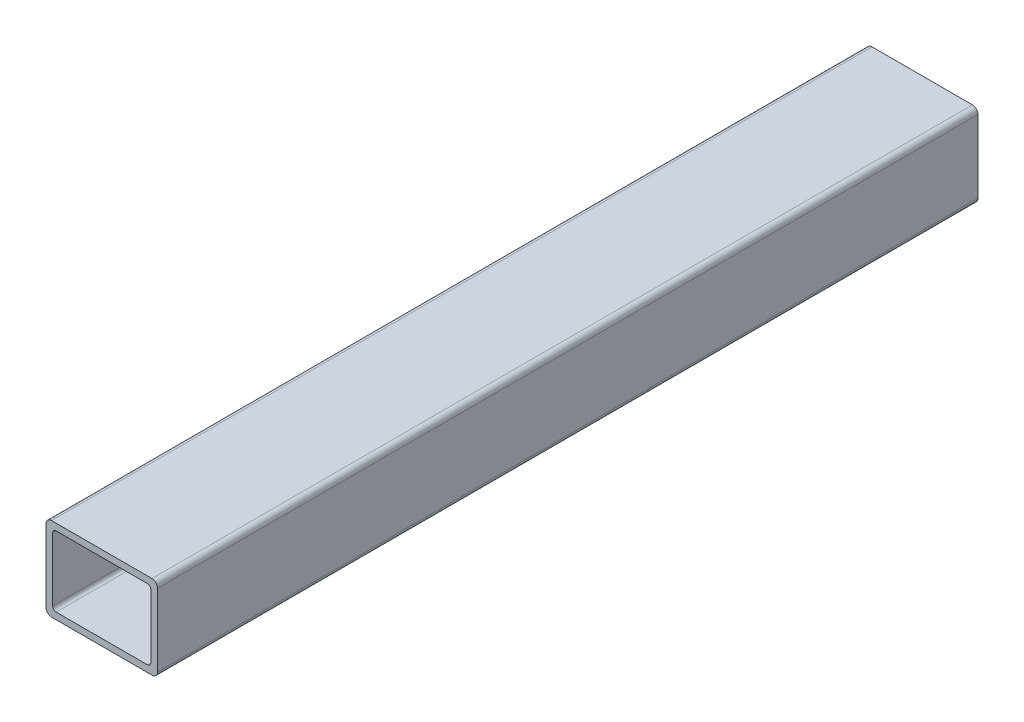
ISO-10303-21;
HEADER;
FILE_DESCRIPTION(('STEP AP214'),'2;1');
FILE_NAME('part.step','',(''),(''),'','','');
FILE_SCHEMA(('AUTOMOTIVE_DESIGN { 1 0 10303 214 1 1 1 1 }'));
ENDSEC;
DATA;
#1=APPLICATION_CONTEXT('core data for automotive mechanical design processes');
#2=APPLICATION_PROTOCOL_DEFINITION('international standard','automotive_design',2000,#1);
#3=PRODUCT_CONTEXT('',#1,'mechanical');
#4=PRODUCT('Part','Part','',(#3));
#5=PRODUCT_RELATED_PRODUCT_CATEGORY('part','',(#4));
#6=PRODUCT_DEFINITION_FORMATION('','',#4);
#7=PRODUCT_DEFINITION_CONTEXT('part definition',#1,'design');
#8=PRODUCT_DEFINITION('design','',#6,#7);
#9=PRODUCT_DEFINITION_SHAPE('','',#8);
#10=(LENGTH_UNIT() NAMED_UNIT(*) SI_UNIT(.MILLI.,.METRE.));
#11=(NAMED_UNIT(*) PLANE_ANGLE_UNIT() SI_UNIT($,.RADIAN.));
#12=(NAMED_UNIT(*) SI_UNIT($,.STERADIAN.) SOLID_ANGLE_UNIT());
#13=UNCERTAINTY_MEASURE_WITH_UNIT(LENGTH_MEASURE(1.E-05),#10,'distance_accuracy_value','');
#14=(GEOMETRIC_REPRESENTATION_CONTEXT(3) GLOBAL_UNCERTAINTY_ASSIGNED_CONTEXT((#13)) GLOBAL_UNIT_ASSIGNED_CONTEXT((#10,
#11,#12)) REPRESENTATION_CONTEXT('',''));
#15=CARTESIAN_POINT('',(0.,0.,0.));
#16=DIRECTION('',(0.,0.,1.));
#17=DIRECTION('',(1.,0.,0.));
#18=AXIS2_PLACEMENT_3D('',#15,#16,#17);
#19=CARTESIAN_POINT('',(22.86,-16.51,373.61368));
#20=DIRECTION('',(0.,0.,1.));
#21=DIRECTION('',(1.,0.,0.));
#22=AXIS2_PLACEMENT_3D('',#19,#20,#21);
#23=PLANE('',#22);
#24=CARTESIAN_POINT('',(22.86,-16.51,373.61368));
#25=DIRECTION('',(0.,0.,1.));
#26=DIRECTION('',(1.,0.,0.));
#27=AXIS2_PLACEMENT_3D('',#24,#25,#26);
#28=CIRCLE('',#27,2.53999999999999);
#29=CARTESIAN_POINT('',(22.86,-19.05,373.61368));
#30=VERTEX_POINT('',#29);
#31=CARTESIAN_POINT('',(25.4,-16.51,373.61368));
#32=VERTEX_POINT('',#31);
#33=EDGE_CURVE('E214',#30,#32,#28,.T.);
#34=ORIENTED_EDGE('',*,*,#33,.T.);
#35=DIRECTION('',(0.,1.,0.));
#36=VECTOR('',#35,1.);
#37=CARTESIAN_POINT('',(25.4,-16.51,373.61368));
#38=LINE('',#37,#36);
#39=CARTESIAN_POINT('',(25.4,16.51,373.61368));
#40=VERTEX_POINT('',#39);
#41=EDGE_CURVE('E217',#32,#40,#38,.T.);
#42=ORIENTED_EDGE('',*,*,#41,.T.);
#43=CARTESIAN_POINT('',(22.86,16.51,373.61368));
#44=DIRECTION('',(0.,0.,1.));
#45=DIRECTION('',(1.,0.,0.));
#46=AXIS2_PLACEMENT_3D('',#43,#44,#45);
#47=CIRCLE('',#46,2.54);
#48=CARTESIAN_POINT('',(22.86,19.05,373.61368));
#49=VERTEX_POINT('',#48);
#50=EDGE_CURVE('E220',#40,#49,#47,.T.);
#51=ORIENTED_EDGE('',*,*,#50,.T.);
#52=DIRECTION('',(-1.,0.,0.));
#53=VECTOR('',#52,1.);
#54=CARTESIAN_POINT('',(22.86,19.05,373.61368));
#55=LINE('',#54,#53);
#56=CARTESIAN_POINT('',(-22.86,19.05,373.61368));
#57=VERTEX_POINT('',#56);
#58=EDGE_CURVE('E222',#49,#57,#55,.T.);
#59=ORIENTED_EDGE('',*,*,#58,.T.);
#60=CARTESIAN_POINT('',(-22.86,16.51,373.61368));
#61=DIRECTION('',(0.,0.,1.));
#62=DIRECTION('',(1.,0.,0.));
#63=AXIS2_PLACEMENT_3D('',#60,#61,#62);
#64=CIRCLE('',#63,2.54);
#65=CARTESIAN_POINT('',(-25.4,16.51,373.61368));
#66=VERTEX_POINT('',#65);
#67=EDGE_CURVE('E224',#57,#66,#64,.T.);
#68=ORIENTED_EDGE('',*,*,#67,.T.);
#69=DIRECTION('',(0.,-1.,0.));
#70=VECTOR('',#69,1.);
#71=CARTESIAN_POINT('',(-25.4,-16.51,373.61368));
#72=LINE('',#71,#70);
#73=CARTESIAN_POINT('',(-25.4,-16.51,373.61368));
#74=VERTEX_POINT('',#73);
#75=EDGE_CURVE('E226',#66,#74,#72,.T.);
#76=ORIENTED_EDGE('',*,*,#75,.T.);
#77=CARTESIAN_POINT('',(-22.86,-16.51,373.61368));
#78=DIRECTION('',(0.,0.,1.));
#79=DIRECTION('',(1.,0.,0.));
#80=AXIS2_PLACEMENT_3D('',#77,#78,#79);
#81=CIRCLE('',#80,2.54);
#82=CARTESIAN_POINT('',(-22.86,-19.05,373.61368));
#83=VERTEX_POINT('',#82);
#84=EDGE_CURVE('E228',#74,#83,#81,.T.);
#85=ORIENTED_EDGE('',*,*,#84,.T.);
#86=DIRECTION('',(1.,0.,0.));
#87=VECTOR('',#86,1.);
#88=CARTESIAN_POINT('',(22.86,-19.05,373.61368));
#89=LINE('',#88,#87);
#90=EDGE_CURVE('E230',#83,#30,#89,.T.);
#91=ORIENTED_EDGE('',*,*,#90,.T.);
#92=EDGE_LOOP('',(#34,#42,#51,#59,#68,#76,#85,#91));
#93=FACE_BOUND('',#92,.T.);
#94=DIRECTION('',(-1.,0.,0.));
#95=VECTOR('',#94,1.);
#96=CARTESIAN_POINT('',(20.7518,16.002,373.61368));
#97=LINE('',#96,#95);
#98=CARTESIAN_POINT('',(20.7518,16.002,373.61368));
#99=VERTEX_POINT('',#98);
#100=CARTESIAN_POINT('',(-20.7518,16.002,373.61368));
#101=VERTEX_POINT('',#100);
#102=EDGE_CURVE('E157',#99,#101,#97,.T.);
#103=ORIENTED_EDGE('',*,*,#102,.F.);
#104=CARTESIAN_POINT('',(20.7518,14.4018,373.61368));
#105=DIRECTION('',(0.,0.,1.));
#106=DIRECTION('',(1.,0.,0.));
#107=AXIS2_PLACEMENT_3D('',#104,#105,#106);
#108=CIRCLE('',#107,1.6002);
#109=CARTESIAN_POINT('',(22.352,14.4018,373.61368));
#110=VERTEX_POINT('',#109);
#111=EDGE_CURVE('E149',#110,#99,#108,.T.);
#112=ORIENTED_EDGE('',*,*,#111,.F.);
#113=DIRECTION('',(0.,1.,0.));
#114=VECTOR('',#113,1.);
#115=CARTESIAN_POINT('',(22.352,14.4018,373.61368));
#116=LINE('',#115,#114);
#117=CARTESIAN_POINT('',(22.352,-14.4018,373.61368));
#118=VERTEX_POINT('',#117);
#119=EDGE_CURVE('E182',#118,#110,#116,.T.);
#120=ORIENTED_EDGE('',*,*,#119,.F.);
#121=CARTESIAN_POINT('',(20.7518,-14.4018,373.61368));
#122=DIRECTION('',(0.,0.,1.));
#123=DIRECTION('',(1.,0.,0.));
#124=AXIS2_PLACEMENT_3D('',#121,#122,#123);
#125=CIRCLE('',#124,1.6002);
#126=CARTESIAN_POINT('',(20.7518,-16.002,373.61368));
#127=VERTEX_POINT('',#126);
#128=EDGE_CURVE('E180',#127,#118,#125,.T.);
#129=ORIENTED_EDGE('',*,*,#128,.F.);
#130=DIRECTION('',(1.,0.,0.));
#131=VECTOR('',#130,1.);
#132=CARTESIAN_POINT('',(20.7518,-16.002,373.61368));
#133=LINE('',#132,#131);
#134=CARTESIAN_POINT('',(-20.7518,-16.002,373.61368));
#135=VERTEX_POINT('',#134);
#136=EDGE_CURVE('E178',#135,#127,#133,.T.);
#137=ORIENTED_EDGE('',*,*,#136,.F.);
#138=CARTESIAN_POINT('',(-20.7518,-14.4018,373.61368));
#139=DIRECTION('',(0.,0.,1.));
#140=DIRECTION('',(1.,0.,0.));
#141=AXIS2_PLACEMENT_3D('',#138,#139,#140);
#142=CIRCLE('',#141,1.6002);
#143=CARTESIAN_POINT('',(-22.352,-14.4018,373.61368));
#144=VERTEX_POINT('',#143);
#145=EDGE_CURVE('E176',#144,#135,#142,.T.);
#146=ORIENTED_EDGE('',*,*,#145,.F.);
#147=DIRECTION('',(0.,-1.,0.));
#148=VECTOR('',#147,1.);
#149=CARTESIAN_POINT('',(-22.352,14.4018,373.61368));
#150=LINE('',#149,#148);
#151=CARTESIAN_POINT('',(-22.352,14.4018,373.61368));
#152=VERTEX_POINT('',#151);
#153=EDGE_CURVE('E172',#152,#144,#150,.T.);
#154=ORIENTED_EDGE('',*,*,#153,.F.);
#155=CARTESIAN_POINT('',(-20.7518,14.4018,373.61368));
#156=DIRECTION('',(0.,0.,1.));
#157=DIRECTION('',(1.,0.,0.));
#158=AXIS2_PLACEMENT_3D('',#155,#156,#157);
#159=CIRCLE('',#158,1.6002);
#160=EDGE_CURVE('E170',#101,#152,#159,.T.);
#161=ORIENTED_EDGE('',*,*,#160,.F.);
#162=EDGE_LOOP('',(#103,#112,#120,#129,#137,#146,#154,#161));
#163=FACE_BOUND('',#162,.T.);
#164=ADVANCED_FACE('F36',(#93,#163),#23,.T.);
#165=CARTESIAN_POINT('',(22.86,-16.51,0.));
#166=DIRECTION('',(0.,0.,1.));
#167=DIRECTION('',(1.,0.,0.));
#168=AXIS2_PLACEMENT_3D('',#165,#166,#167);
#169=PLANE('',#168);
#170=CARTESIAN_POINT('',(22.86,-16.51,0.));
#171=DIRECTION('',(0.,0.,1.));
#172=DIRECTION('',(1.,0.,0.));
#173=AXIS2_PLACEMENT_3D('',#170,#171,#172);
#174=CIRCLE('',#173,2.53999999999999);
#175=CARTESIAN_POINT('',(22.86,-19.05,0.));
#176=VERTEX_POINT('',#175);
#177=CARTESIAN_POINT('',(25.4,-16.51,0.));
#178=VERTEX_POINT('',#177);
#179=EDGE_CURVE('E165',#176,#178,#174,.T.);
#180=ORIENTED_EDGE('',*,*,#179,.F.);
#181=DIRECTION('',(1.,0.,0.));
#182=VECTOR('',#181,1.);
#183=CARTESIAN_POINT('',(22.86,-19.05,0.));
#184=LINE('',#183,#182);
#185=CARTESIAN_POINT('',(-22.86,-19.05,0.));
#186=VERTEX_POINT('',#185);
#187=EDGE_CURVE('E218',#186,#176,#184,.T.);
#188=ORIENTED_EDGE('',*,*,#187,.F.);
#189=CARTESIAN_POINT('',(-22.86,-16.51,0.));
#190=DIRECTION('',(0.,0.,1.));
#191=DIRECTION('',(1.,0.,0.));
#192=AXIS2_PLACEMENT_3D('',#189,#190,#191);
#193=CIRCLE('',#192,2.54);
#194=CARTESIAN_POINT('',(-25.4,-16.51,0.));
#195=VERTEX_POINT('',#194);
#196=EDGE_CURVE('E245',#195,#186,#193,.T.);
#197=ORIENTED_EDGE('',*,*,#196,.F.);
#198=DIRECTION('',(0.,-1.,0.));
#199=VECTOR('',#198,1.);
#200=CARTESIAN_POINT('',(-25.4,-16.51,0.));
#201=LINE('',#200,#199);
#202=CARTESIAN_POINT('',(-25.4,16.51,0.));
#203=VERTEX_POINT('',#202);
#204=EDGE_CURVE('E243',#203,#195,#201,.T.);
#205=ORIENTED_EDGE('',*,*,#204,.F.);
#206=CARTESIAN_POINT('',(-22.86,16.51,0.));
#207=DIRECTION('',(0.,0.,1.));
#208=DIRECTION('',(1.,0.,0.));
#209=AXIS2_PLACEMENT_3D('',#206,#207,#208);
#210=CIRCLE('',#209,2.54);
#211=CARTESIAN_POINT('',(-22.86,19.05,0.));
#212=VERTEX_POINT('',#211);
#213=EDGE_CURVE('E241',#212,#203,#210,.T.);
#214=ORIENTED_EDGE('',*,*,#213,.F.);
#215=DIRECTION('',(-1.,0.,0.));
#216=VECTOR('',#215,1.);
#217=CARTESIAN_POINT('',(22.86,19.05,0.));
#218=LINE('',#217,#216);
#219=CARTESIAN_POINT('',(22.86,19.05,0.));
#220=VERTEX_POINT('',#219);
#221=EDGE_CURVE('E239',#220,#212,#218,.T.);
#222=ORIENTED_EDGE('',*,*,#221,.F.);
#223=CARTESIAN_POINT('',(22.86,16.51,0.));
#224=DIRECTION('',(0.,0.,1.));
#225=DIRECTION('',(1.,0.,0.));
#226=AXIS2_PLACEMENT_3D('',#223,#224,#225);
#227=CIRCLE('',#226,2.54);
#228=CARTESIAN_POINT('',(25.4,16.51,0.));
#229=VERTEX_POINT('',#228);
#230=EDGE_CURVE('E237',#229,#220,#227,.T.);
#231=ORIENTED_EDGE('',*,*,#230,.F.);
#232=DIRECTION('',(0.,1.,0.));
#233=VECTOR('',#232,1.);
#234=CARTESIAN_POINT('',(25.4,-16.51,0.));
#235=LINE('',#234,#233);
#236=EDGE_CURVE('E235',#178,#229,#235,.T.);
#237=ORIENTED_EDGE('',*,*,#236,.F.);
#238=EDGE_LOOP('',(#180,#188,#197,#205,#214,#222,#231,#237));
#239=FACE_BOUND('',#238,.T.);
#240=CARTESIAN_POINT('',(20.7518,14.4018,0.));
#241=DIRECTION('',(0.,0.,1.));
#242=DIRECTION('',(1.,0.,0.));
#243=AXIS2_PLACEMENT_3D('',#240,#241,#242);
#244=CIRCLE('',#243,1.6002);
#245=CARTESIAN_POINT('',(22.352,14.4018,0.));
#246=VERTEX_POINT('',#245);
#247=CARTESIAN_POINT('',(20.7518,16.002,0.));
#248=VERTEX_POINT('',#247);
#249=EDGE_CURVE('E59',#246,#248,#244,.T.);
#250=ORIENTED_EDGE('',*,*,#249,.T.);
#251=DIRECTION('',(-1.,0.,0.));
#252=VECTOR('',#251,1.);
#253=CARTESIAN_POINT('',(20.7518,16.002,0.));
#254=LINE('',#253,#252);
#255=CARTESIAN_POINT('',(-20.7518,16.002,0.));
#256=VERTEX_POINT('',#255);
#257=EDGE_CURVE('E164',#248,#256,#254,.T.);
#258=ORIENTED_EDGE('',*,*,#257,.T.);
#259=CARTESIAN_POINT('',(-20.7518,14.4018,0.));
#260=DIRECTION('',(0.,0.,1.));
#261=DIRECTION('',(1.,0.,0.));
#262=AXIS2_PLACEMENT_3D('',#259,#260,#261);
#263=CIRCLE('',#262,1.6002);
#264=CARTESIAN_POINT('',(-22.352,14.4018,0.));
#265=VERTEX_POINT('',#264);
#266=EDGE_CURVE('E186',#256,#265,#263,.T.);
#267=ORIENTED_EDGE('',*,*,#266,.T.);
#268=DIRECTION('',(0.,-1.,0.));
#269=VECTOR('',#268,1.);
#270=CARTESIAN_POINT('',(-22.352,14.4018,0.));
#271=LINE('',#270,#269);
#272=CARTESIAN_POINT('',(-22.352,-14.4018,0.));
#273=VERTEX_POINT('',#272);
#274=EDGE_CURVE('E189',#265,#273,#271,.T.);
#275=ORIENTED_EDGE('',*,*,#274,.T.);
#276=CARTESIAN_POINT('',(-20.7518,-14.4018,0.));
#277=DIRECTION('',(0.,0.,1.));
#278=DIRECTION('',(1.,0.,0.));
#279=AXIS2_PLACEMENT_3D('',#276,#277,#278);
#280=CIRCLE('',#279,1.6002);
#281=CARTESIAN_POINT('',(-20.7518,-16.002,0.));
#282=VERTEX_POINT('',#281);
#283=EDGE_CURVE('E192',#273,#282,#280,.T.);
#284=ORIENTED_EDGE('',*,*,#283,.T.);
#285=DIRECTION('',(1.,0.,0.));
#286=VECTOR('',#285,1.);
#287=CARTESIAN_POINT('',(20.7518,-16.002,0.));
#288=LINE('',#287,#286);
#289=CARTESIAN_POINT('',(20.7518,-16.002,0.));
#290=VERTEX_POINT('',#289);
#291=EDGE_CURVE('E195',#282,#290,#288,.T.);
#292=ORIENTED_EDGE('',*,*,#291,.T.);
#293=CARTESIAN_POINT('',(20.7518,-14.4018,0.));
#294=DIRECTION('',(0.,0.,1.));
#295=DIRECTION('',(1.,0.,0.));
#296=AXIS2_PLACEMENT_3D('',#293,#294,#295);
#297=CIRCLE('',#296,1.6002);
#298=CARTESIAN_POINT('',(22.352,-14.4018,0.));
#299=VERTEX_POINT('',#298);
#300=EDGE_CURVE('E198',#290,#299,#297,.T.);
#301=ORIENTED_EDGE('',*,*,#300,.T.);
#302=DIRECTION('',(0.,1.,0.));
#303=VECTOR('',#302,1.);
#304=CARTESIAN_POINT('',(22.352,14.4018,0.));
#305=LINE('',#304,#303);
#306=EDGE_CURVE('E158',#299,#246,#305,.T.);
#307=ORIENTED_EDGE('',*,*,#306,.T.);
#308=EDGE_LOOP('',(#250,#258,#267,#275,#284,#292,#301,#307));
#309=FACE_BOUND('',#308,.T.);
#310=ADVANCED_FACE('F275',(#239,#309),#169,.F.);
#311=CARTESIAN_POINT('',(22.86,-16.51,373.61368));
#312=DIRECTION('',(0.,0.,-1.));
#313=DIRECTION('',(-1.,0.,0.));
#314=AXIS2_PLACEMENT_3D('',#311,#312,#313);
#315=CYLINDRICAL_SURFACE('',#314,2.53999999999999);
#316=ORIENTED_EDGE('',*,*,#179,.T.);
#317=DIRECTION('',(0.,0.,-1.));
#318=VECTOR('',#317,1.);
#319=CARTESIAN_POINT('',(25.4,-16.51,373.61368));
#320=LINE('',#319,#318);
#321=EDGE_CURVE('E11',#32,#178,#320,.T.);
#322=ORIENTED_EDGE('',*,*,#321,.F.);
#323=ORIENTED_EDGE('',*,*,#33,.F.);
#324=DIRECTION('',(0.,0.,-1.));
#325=VECTOR('',#324,1.);
#326=CARTESIAN_POINT('',(22.86,-19.05,373.61368));
#327=LINE('',#326,#325);
#328=EDGE_CURVE('E232',#30,#176,#327,.T.);
#329=ORIENTED_EDGE('',*,*,#328,.T.);
#330=EDGE_LOOP('',(#316,#322,#323,#329));
#331=FACE_BOUND('',#330,.T.);
#332=ADVANCED_FACE('F38',(#331),#315,.T.);
#333=CARTESIAN_POINT('',(25.4,-16.51,373.61368));
#334=DIRECTION('',(-1.,0.,0.));
#335=DIRECTION('',(0.,0.,1.));
#336=AXIS2_PLACEMENT_3D('',#333,#334,#335);
#337=PLANE('',#336);
#338=ORIENTED_EDGE('',*,*,#236,.T.);
#339=DIRECTION('',(0.,0.,-1.));
#340=VECTOR('',#339,1.);
#341=CARTESIAN_POINT('',(25.4,16.51,373.61368));
#342=LINE('',#341,#340);
#343=EDGE_CURVE('E44',#40,#229,#342,.T.);
#344=ORIENTED_EDGE('',*,*,#343,.F.);
#345=ORIENTED_EDGE('',*,*,#41,.F.);
#346=ORIENTED_EDGE('',*,*,#321,.T.);
#347=EDGE_LOOP('',(#338,#344,#345,#346));
#348=FACE_BOUND('',#347,.T.);
#349=ADVANCED_FACE('F292',(#348),#337,.F.);
#350=CARTESIAN_POINT('',(22.86,16.51,373.61368));
#351=DIRECTION('',(0.,0.,-1.));
#352=DIRECTION('',(-1.,0.,0.));
#353=AXIS2_PLACEMENT_3D('',#350,#351,#352);
#354=CYLINDRICAL_SURFACE('',#353,2.54);
#355=ORIENTED_EDGE('',*,*,#230,.T.);
#356=DIRECTION('',(0.,0.,-1.));
#357=VECTOR('',#356,1.);
#358=CARTESIAN_POINT('',(22.86,19.05,373.61368));
#359=LINE('',#358,#357);
#360=EDGE_CURVE('E262',#49,#220,#359,.T.);
#361=ORIENTED_EDGE('',*,*,#360,.F.);
#362=ORIENTED_EDGE('',*,*,#50,.F.);
#363=ORIENTED_EDGE('',*,*,#343,.T.);
#364=EDGE_LOOP('',(#355,#361,#362,#363));
#365=FACE_BOUND('',#364,.T.);
#366=ADVANCED_FACE('F269',(#365),#354,.T.);
#367=CARTESIAN_POINT('',(22.86,19.05,373.61368));
#368=DIRECTION('',(0.,-1.,0.));
#369=DIRECTION('',(0.,0.,-1.));
#370=AXIS2_PLACEMENT_3D('',#367,#368,#369);
#371=PLANE('',#370);
#372=ORIENTED_EDGE('',*,*,#221,.T.);
#373=DIRECTION('',(0.,0.,-1.));
#374=VECTOR('',#373,1.);
#375=CARTESIAN_POINT('',(-22.86,19.05,373.61368));
#376=LINE('',#375,#374);
#377=EDGE_CURVE('E259',#57,#212,#376,.T.);
#378=ORIENTED_EDGE('',*,*,#377,.F.);
#379=ORIENTED_EDGE('',*,*,#58,.F.);
#380=ORIENTED_EDGE('',*,*,#360,.T.);
#381=EDGE_LOOP('',(#372,#378,#379,#380));
#382=FACE_BOUND('',#381,.T.);
#383=ADVANCED_FACE('F281',(#382),#371,.F.);
#384=CARTESIAN_POINT('',(-22.86,16.51,373.61368));
#385=DIRECTION('',(0.,0.,-1.));
#386=DIRECTION('',(-1.,0.,0.));
#387=AXIS2_PLACEMENT_3D('',#384,#385,#386);
#388=CYLINDRICAL_SURFACE('',#387,2.54);
#389=ORIENTED_EDGE('',*,*,#213,.T.);
#390=DIRECTION('',(0.,0.,-1.));
#391=VECTOR('',#390,1.);
#392=CARTESIAN_POINT('',(-25.4,16.51,373.61368));
#393=LINE('',#392,#391);
#394=EDGE_CURVE('E256',#66,#203,#393,.T.);
#395=ORIENTED_EDGE('',*,*,#394,.F.);
#396=ORIENTED_EDGE('',*,*,#67,.F.);
#397=ORIENTED_EDGE('',*,*,#377,.T.);
#398=EDGE_LOOP('',(#389,#395,#396,#397));
#399=FACE_BOUND('',#398,.T.);
#400=ADVANCED_FACE('F285',(#399),#388,.T.);
#401=CARTESIAN_POINT('',(-25.4,-16.51,373.61368));
#402=DIRECTION('',(1.,0.,0.));
#403=DIRECTION('',(0.,1.,0.));
#404=AXIS2_PLACEMENT_3D('',#401,#402,#403);
#405=PLANE('',#404);
#406=ORIENTED_EDGE('',*,*,#204,.T.);
#407=DIRECTION('',(0.,0.,-1.));
#408=VECTOR('',#407,1.);
#409=CARTESIAN_POINT('',(-25.4,-16.51,373.61368));
#410=LINE('',#409,#408);
#411=EDGE_CURVE('E253',#74,#195,#410,.T.);
#412=ORIENTED_EDGE('',*,*,#411,.F.);
#413=ORIENTED_EDGE('',*,*,#75,.F.);
#414=ORIENTED_EDGE('',*,*,#394,.T.);
#415=EDGE_LOOP('',(#406,#412,#413,#414));
#416=FACE_BOUND('',#415,.T.);
#417=ADVANCED_FACE('F305',(#416),#405,.F.);
#418=CARTESIAN_POINT('',(-22.86,-16.51,373.61368));
#419=DIRECTION('',(0.,0.,-1.));
#420=DIRECTION('',(-1.,0.,0.));
#421=AXIS2_PLACEMENT_3D('',#418,#419,#420);
#422=CYLINDRICAL_SURFACE('',#421,2.54);
#423=ORIENTED_EDGE('',*,*,#196,.T.);
#424=DIRECTION('',(0.,0.,-1.));
#425=VECTOR('',#424,1.);
#426=CARTESIAN_POINT('',(-22.86,-19.05,373.61368));
#427=LINE('',#426,#425);
#428=EDGE_CURVE('E250',#83,#186,#427,.T.);
#429=ORIENTED_EDGE('',*,*,#428,.F.);
#430=ORIENTED_EDGE('',*,*,#84,.F.);
#431=ORIENTED_EDGE('',*,*,#411,.T.);
#432=EDGE_LOOP('',(#423,#429,#430,#431));
#433=FACE_BOUND('',#432,.T.);
#434=ADVANCED_FACE('F303',(#433),#422,.T.);
#435=CARTESIAN_POINT('',(22.86,-19.05,373.61368));
#436=DIRECTION('',(0.,1.,0.));
#437=DIRECTION('',(-1.,0.,0.));
#438=AXIS2_PLACEMENT_3D('',#435,#436,#437);
#439=PLANE('',#438);
#440=ORIENTED_EDGE('',*,*,#187,.T.);
#441=ORIENTED_EDGE('',*,*,#328,.F.);
#442=ORIENTED_EDGE('',*,*,#90,.F.);
#443=ORIENTED_EDGE('',*,*,#428,.T.);
#444=EDGE_LOOP('',(#440,#441,#442,#443));
#445=FACE_BOUND('',#444,.T.);
#446=ADVANCED_FACE('F298',(#445),#439,.F.);
#447=CARTESIAN_POINT('',(20.7518,14.4018,373.61368));
#448=DIRECTION('',(0.,0.,-1.));
#449=DIRECTION('',(-1.,0.,0.));
#450=AXIS2_PLACEMENT_3D('',#447,#448,#449);
#451=CYLINDRICAL_SURFACE('',#450,1.6002);
#452=ORIENTED_EDGE('',*,*,#249,.F.);
#453=DIRECTION('',(0.,0.,-1.));
#454=VECTOR('',#453,1.);
#455=CARTESIAN_POINT('',(22.352,14.4018,373.61368));
#456=LINE('',#455,#454);
#457=EDGE_CURVE('E153',#110,#246,#456,.T.);
#458=ORIENTED_EDGE('',*,*,#457,.F.);
#459=ORIENTED_EDGE('',*,*,#111,.T.);
#460=DIRECTION('',(0.,0.,-1.));
#461=VECTOR('',#460,1.);
#462=CARTESIAN_POINT('',(20.7518,16.002,373.61368));
#463=LINE('',#462,#461);
#464=EDGE_CURVE('E152',#99,#248,#463,.T.);
#465=ORIENTED_EDGE('',*,*,#464,.T.);
#466=EDGE_LOOP('',(#452,#458,#459,#465));
#467=FACE_BOUND('',#466,.T.);
#468=ADVANCED_FACE('F151',(#467),#451,.F.);
#469=CARTESIAN_POINT('',(20.7518,16.002,373.61368));
#470=DIRECTION('',(0.,-1.,0.));
#471=DIRECTION('',(1.,0.,0.));
#472=AXIS2_PLACEMENT_3D('',#469,#470,#471);
#473=PLANE('',#472);
#474=ORIENTED_EDGE('',*,*,#257,.F.);
#475=ORIENTED_EDGE('',*,*,#464,.F.);
#476=ORIENTED_EDGE('',*,*,#102,.T.);
#477=DIRECTION('',(0.,0.,-1.));
#478=VECTOR('',#477,1.);
#479=CARTESIAN_POINT('',(-20.7518,16.002,373.61368));
#480=LINE('',#479,#478);
#481=EDGE_CURVE('E166',#101,#256,#480,.T.);
#482=ORIENTED_EDGE('',*,*,#481,.T.);
#483=EDGE_LOOP('',(#474,#475,#476,#482));
#484=FACE_BOUND('',#483,.T.);
#485=ADVANCED_FACE('F161',(#484),#473,.T.);
#486=CARTESIAN_POINT('',(-20.7518,14.4018,373.61368));
#487=DIRECTION('',(0.,0.,-1.));
#488=DIRECTION('',(-1.,0.,0.));
#489=AXIS2_PLACEMENT_3D('',#486,#487,#488);
#490=CYLINDRICAL_SURFACE('',#489,1.6002);
#491=ORIENTED_EDGE('',*,*,#266,.F.);
#492=ORIENTED_EDGE('',*,*,#481,.F.);
#493=ORIENTED_EDGE('',*,*,#160,.T.);
#494=DIRECTION('',(0.,0.,-1.));
#495=VECTOR('',#494,1.);
#496=CARTESIAN_POINT('',(-22.352,14.4018,373.61368));
#497=LINE('',#496,#495);
#498=EDGE_CURVE('E211',#152,#265,#497,.T.);
#499=ORIENTED_EDGE('',*,*,#498,.T.);
#500=EDGE_LOOP('',(#491,#492,#493,#499));
#501=FACE_BOUND('',#500,.T.);
#502=ADVANCED_FACE('F330',(#501),#490,.F.);
#503=CARTESIAN_POINT('',(-22.352,14.4018,373.61368));
#504=DIRECTION('',(1.,0.,0.));
#505=DIRECTION('',(0.,1.,0.));
#506=AXIS2_PLACEMENT_3D('',#503,#504,#505);
#507=PLANE('',#506);
#508=ORIENTED_EDGE('',*,*,#274,.F.);
#509=ORIENTED_EDGE('',*,*,#498,.F.);
#510=ORIENTED_EDGE('',*,*,#153,.T.);
#511=DIRECTION('',(0.,0.,-1.));
#512=VECTOR('',#511,1.);
#513=CARTESIAN_POINT('',(-22.352,-14.4018,373.61368));
#514=LINE('',#513,#512);
#515=EDGE_CURVE('E209',#144,#273,#514,.T.);
#516=ORIENTED_EDGE('',*,*,#515,.T.);
#517=EDGE_LOOP('',(#508,#509,#510,#516));
#518=FACE_BOUND('',#517,.T.);
#519=ADVANCED_FACE('F334',(#518),#507,.T.);
#520=CARTESIAN_POINT('',(-20.7518,-14.4018,373.61368));
#521=DIRECTION('',(0.,0.,-1.));
#522=DIRECTION('',(-1.,0.,0.));
#523=AXIS2_PLACEMENT_3D('',#520,#521,#522);
#524=CYLINDRICAL_SURFACE('',#523,1.6002);
#525=ORIENTED_EDGE('',*,*,#283,.F.);
#526=ORIENTED_EDGE('',*,*,#515,.F.);
#527=ORIENTED_EDGE('',*,*,#145,.T.);
#528=DIRECTION('',(0.,0.,-1.));
#529=VECTOR('',#528,1.);
#530=CARTESIAN_POINT('',(-20.7518,-16.002,373.61368));
#531=LINE('',#530,#529);
#532=EDGE_CURVE('E207',#135,#282,#531,.T.);
#533=ORIENTED_EDGE('',*,*,#532,.T.);
#534=EDGE_LOOP('',(#525,#526,#527,#533));
#535=FACE_BOUND('',#534,.T.);
#536=ADVANCED_FACE('F340',(#535),#524,.F.);
#537=CARTESIAN_POINT('',(20.7518,-16.002,373.61368));
#538=DIRECTION('',(0.,1.,0.));
#539=DIRECTION('',(-1.,0.,0.));
#540=AXIS2_PLACEMENT_3D('',#537,#538,#539);
#541=PLANE('',#540);
#542=ORIENTED_EDGE('',*,*,#291,.F.);
#543=ORIENTED_EDGE('',*,*,#532,.F.);
#544=ORIENTED_EDGE('',*,*,#136,.T.);
#545=DIRECTION('',(0.,0.,-1.));
#546=VECTOR('',#545,1.);
#547=CARTESIAN_POINT('',(20.7518,-16.002,373.61368));
#548=LINE('',#547,#546);
#549=EDGE_CURVE('E205',#127,#290,#548,.T.);
#550=ORIENTED_EDGE('',*,*,#549,.T.);
#551=EDGE_LOOP('',(#542,#543,#544,#550));
#552=FACE_BOUND('',#551,.T.);
#553=ADVANCED_FACE('F344',(#552),#541,.T.);
#554=CARTESIAN_POINT('',(20.7518,-14.4018,373.61368));
#555=DIRECTION('',(0.,0.,-1.));
#556=DIRECTION('',(-1.,0.,0.));
#557=AXIS2_PLACEMENT_3D('',#554,#555,#556);
#558=CYLINDRICAL_SURFACE('',#557,1.6002);
#559=ORIENTED_EDGE('',*,*,#300,.F.);
#560=ORIENTED_EDGE('',*,*,#549,.F.);
#561=ORIENTED_EDGE('',*,*,#128,.T.);
#562=DIRECTION('',(0.,0.,-1.));
#563=VECTOR('',#562,1.);
#564=CARTESIAN_POINT('',(22.352,-14.4018,373.61368));
#565=LINE('',#564,#563);
#566=EDGE_CURVE('E51',#118,#299,#565,.T.);
#567=ORIENTED_EDGE('',*,*,#566,.T.);
#568=EDGE_LOOP('',(#559,#560,#561,#567));
#569=FACE_BOUND('',#568,.T.);
#570=ADVANCED_FACE('F348',(#569),#558,.F.);
#571=CARTESIAN_POINT('',(22.352,14.4018,373.61368));
#572=DIRECTION('',(-1.,0.,0.));
#573=DIRECTION('',(0.,-1.,0.));
#574=AXIS2_PLACEMENT_3D('',#571,#572,#573);
#575=PLANE('',#574);
#576=ORIENTED_EDGE('',*,*,#306,.F.);
#577=ORIENTED_EDGE('',*,*,#566,.F.);
#578=ORIENTED_EDGE('',*,*,#119,.T.);
#579=ORIENTED_EDGE('',*,*,#457,.T.);
#580=EDGE_LOOP('',(#576,#577,#578,#579));
#581=FACE_BOUND('',#580,.T.);
#582=ADVANCED_FACE('F352',(#581),#575,.T.);
#583=CLOSED_SHELL('',(#164,#310,#332,#349,#366,#383,#400,#417,#434,#446,#468,#485,#502,#519,
#536,#553,#570,#582));
#584=MANIFOLD_SOLID_BREP('B2',#583);
#585=ADVANCED_BREP_SHAPE_REPRESENTATION('',(#18,#584),#14);
#586=SHAPE_DEFINITION_REPRESENTATION(#9,#585);
ENDSEC;
END-ISO-10303-21;
